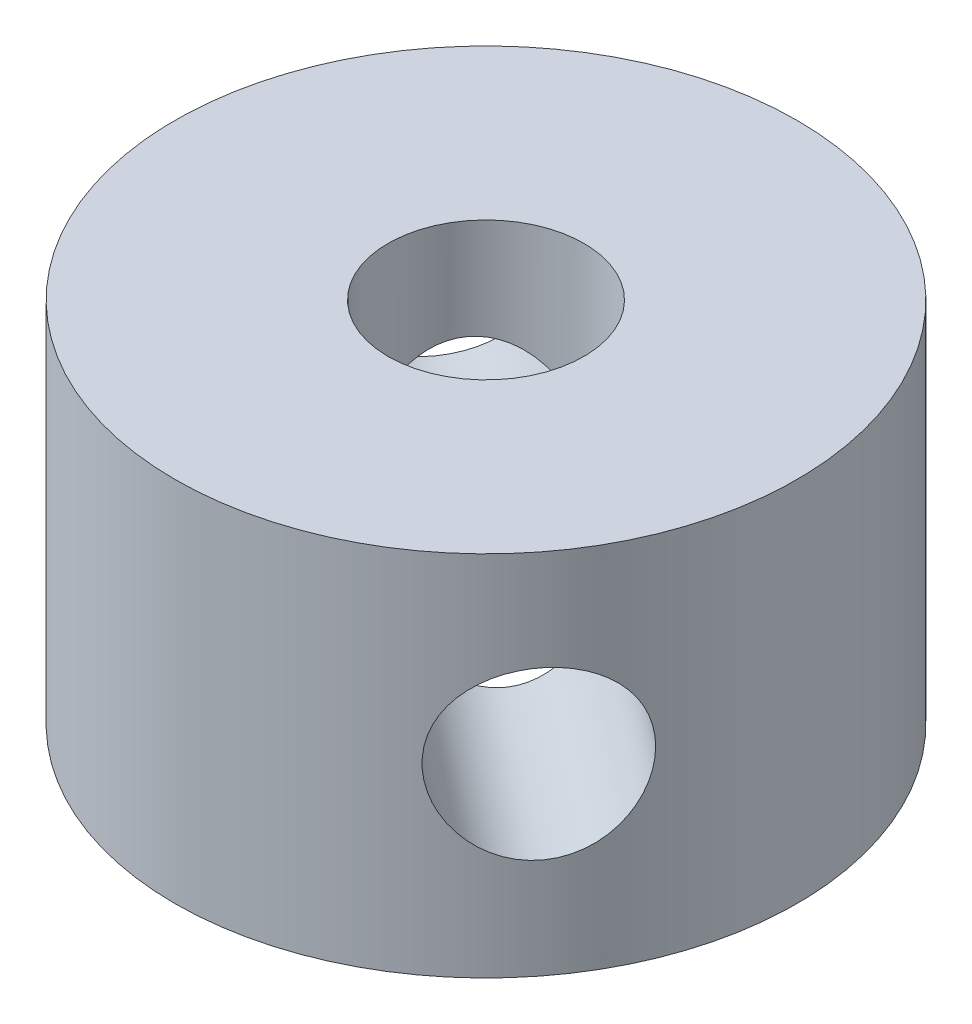
ISO-10303-21;
HEADER;
FILE_DESCRIPTION(('STEP AP214'),'2;1');
FILE_NAME('part.step','',(''),(''),'','','');
FILE_SCHEMA(('AUTOMOTIVE_DESIGN { 1 0 10303 214 1 1 1 1 }'));
ENDSEC;
DATA;
#1=APPLICATION_CONTEXT('core data for automotive mechanical design processes');
#2=APPLICATION_PROTOCOL_DEFINITION('international standard','automotive_design',2000,#1);
#3=PRODUCT_CONTEXT('',#1,'mechanical');
#4=PRODUCT('Part','Part','',(#3));
#5=PRODUCT_RELATED_PRODUCT_CATEGORY('part','',(#4));
#6=PRODUCT_DEFINITION_FORMATION('','',#4);
#7=PRODUCT_DEFINITION_CONTEXT('part definition',#1,'design');
#8=PRODUCT_DEFINITION('design','',#6,#7);
#9=PRODUCT_DEFINITION_SHAPE('','',#8);
#10=(LENGTH_UNIT() NAMED_UNIT(*) SI_UNIT(.MILLI.,.METRE.));
#11=(NAMED_UNIT(*) PLANE_ANGLE_UNIT() SI_UNIT($,.RADIAN.));
#12=(NAMED_UNIT(*) SI_UNIT($,.STERADIAN.) SOLID_ANGLE_UNIT());
#13=UNCERTAINTY_MEASURE_WITH_UNIT(LENGTH_MEASURE(1.E-05),#10,'distance_accuracy_value','');
#14=(GEOMETRIC_REPRESENTATION_CONTEXT(3) GLOBAL_UNCERTAINTY_ASSIGNED_CONTEXT((#13)) GLOBAL_UNIT_ASSIGNED_CONTEXT((#10,
#11,#12)) REPRESENTATION_CONTEXT('',''));
#15=CARTESIAN_POINT('',(0.,0.,0.));
#16=DIRECTION('',(0.,0.,1.));
#17=DIRECTION('',(1.,0.,0.));
#18=AXIS2_PLACEMENT_3D('',#15,#16,#17);
#19=CARTESIAN_POINT('',(0.,15.,0.));
#20=DIRECTION('',(0.,1.,0.));
#21=DIRECTION('',(0.,0.,1.));
#22=AXIS2_PLACEMENT_3D('',#19,#20,#21);
#23=PLANE('',#22);
#24=CARTESIAN_POINT('',(0.,15.,0.));
#25=DIRECTION('',(0.,1.,0.));
#26=DIRECTION('',(0.,0.,1.));
#27=AXIS2_PLACEMENT_3D('',#24,#25,#26);
#28=CIRCLE('',#27,12.7);
#29=CARTESIAN_POINT('',(0.,15.,12.7));
#30=VERTEX_POINT('',#29);
#31=EDGE_CURVE('E10',#30,#30,#28,.T.);
#32=ORIENTED_EDGE('',*,*,#31,.T.);
#33=EDGE_LOOP('',(#32));
#34=FACE_BOUND('',#33,.T.);
#35=CARTESIAN_POINT('',(0.,15.,0.));
#36=DIRECTION('',(0.,1.,0.));
#37=DIRECTION('',(0.,0.,1.));
#38=AXIS2_PLACEMENT_3D('',#35,#36,#37);
#39=CIRCLE('',#38,4.);
#40=CARTESIAN_POINT('',(0.,15.,4.));
#41=VERTEX_POINT('',#40);
#42=EDGE_CURVE('E47',#41,#41,#39,.T.);
#43=ORIENTED_EDGE('',*,*,#42,.F.);
#44=EDGE_LOOP('',(#43));
#45=FACE_BOUND('',#44,.T.);
#46=ADVANCED_FACE('F29',(#34,#45),#23,.T.);
#47=CARTESIAN_POINT('',(0.,0.,0.));
#48=DIRECTION('',(0.,1.,0.));
#49=DIRECTION('',(0.,0.,1.));
#50=AXIS2_PLACEMENT_3D('',#47,#48,#49);
#51=PLANE('',#50);
#52=CARTESIAN_POINT('',(0.,0.,0.));
#53=DIRECTION('',(0.,1.,0.));
#54=DIRECTION('',(0.,0.,1.));
#55=AXIS2_PLACEMENT_3D('',#52,#53,#54);
#56=CIRCLE('',#55,12.7);
#57=CARTESIAN_POINT('',(0.,0.,12.7));
#58=VERTEX_POINT('',#57);
#59=EDGE_CURVE('E42',#58,#58,#56,.T.);
#60=ORIENTED_EDGE('',*,*,#59,.F.);
#61=EDGE_LOOP('',(#60));
#62=FACE_BOUND('',#61,.T.);
#63=CARTESIAN_POINT('',(0.,0.,0.));
#64=DIRECTION('',(0.,1.,0.));
#65=DIRECTION('',(0.,0.,1.));
#66=AXIS2_PLACEMENT_3D('',#63,#64,#65);
#67=CIRCLE('',#66,4.);
#68=CARTESIAN_POINT('',(0.,0.,4.));
#69=VERTEX_POINT('',#68);
#70=EDGE_CURVE('E50',#69,#69,#67,.T.);
#71=ORIENTED_EDGE('',*,*,#70,.T.);
#72=EDGE_LOOP('',(#71));
#73=FACE_BOUND('',#72,.T.);
#74=ADVANCED_FACE('F83',(#62,#73),#51,.F.);
#75=CARTESIAN_POINT('',(0.,15.,0.));
#76=DIRECTION('',(0.,-1.,0.));
#77=DIRECTION('',(0.,0.,-1.));
#78=AXIS2_PLACEMENT_3D('',#75,#76,#77);
#79=CYLINDRICAL_SURFACE('',#78,12.7);
#80=CARTESIAN_POINT('',(-7.57783832704568,7.5,-10.1914849893996));
#81=CARTESIAN_POINT('',(-7.5778436047528,7.68726973662798,-10.1914834420314));
#82=CARTESIAN_POINT('',(-7.59079414651676,7.87458655293833,-10.1818905849294));
#83=CARTESIAN_POINT('',(-7.6418597963996,8.24380846684743,-10.1436168828269));
#84=CARTESIAN_POINT('',(-7.67998739980899,8.42571083040032,-10.1149265597619));
#85=CARTESIAN_POINT('',(-7.77921370792836,8.77870912995359,-10.0388100963512));
#86=CARTESIAN_POINT('',(-7.84027993677805,8.94981994619633,-9.99141043935746));
#87=CARTESIAN_POINT('',(-7.98228728910249,9.27707540057226,-9.87832449553057));
#88=CARTESIAN_POINT('',(-8.06323000109302,9.43321884113498,-9.81263674706868));
#89=CARTESIAN_POINT('',(-8.24332596919391,9.73004359225751,-9.66186550021349));
#90=CARTESIAN_POINT('',(-8.34285201261102,9.870291718828,-9.57637430517092));
#91=CARTESIAN_POINT('',(-8.55452011076351,10.1275144693224,-9.3877712153447));
#92=CARTESIAN_POINT('',(-8.66666348028813,10.2444866642538,-9.28465748362143));
#93=CARTESIAN_POINT('',(-8.90093289629711,10.4536457229853,-9.0603571782758));
#94=CARTESIAN_POINT('',(-9.02319095570416,10.545401605151,-8.93890552481103));
#95=CARTESIAN_POINT('',(-9.27121194111815,10.6987121552296,-8.68139023531302));
#96=CARTESIAN_POINT('',(-9.39697426744019,10.7602719574562,-8.54532908816683));
#97=CARTESIAN_POINT('',(-9.64435728601031,10.8500399767108,-8.26501630414344));
#98=CARTESIAN_POINT('',(-9.76600657586395,10.8789851457648,-8.12102617671603));
#99=CARTESIAN_POINT('',(-10.0040007787032,10.9050211856545,-7.8259738298319));
#100=CARTESIAN_POINT('',(-10.1203465829009,10.9021174284324,-7.67491280729929));
#101=CARTESIAN_POINT('',(-10.3414418268925,10.8650562824657,-7.37418140314894));
#102=CARTESIAN_POINT('',(-10.4464108526457,10.8316951615962,-7.22457326833038));
#103=CARTESIAN_POINT('',(-10.645689678811,10.735953115979,-6.92757480809791));
#104=CARTESIAN_POINT('',(-10.7399988686368,10.6735705299526,-6.78018461014427));
#105=CARTESIAN_POINT('',(-10.9173348379818,10.5209482305128,-6.49083268834331));
#106=CARTESIAN_POINT('',(-11.0002394543113,10.4304363696598,-6.3489399298484));
#107=CARTESIAN_POINT('',(-11.1529068786385,10.2243338871114,-6.07676357419525));
#108=CARTESIAN_POINT('',(-11.2226671025521,10.1087383437522,-5.94648226240352));
#109=CARTESIAN_POINT('',(-11.3508329288665,9.85152573608237,-5.69813521241583));
#110=CARTESIAN_POINT('',(-11.4088205075063,9.70921430616648,-5.58057205153704));
#111=CARTESIAN_POINT('',(-11.510861466101,9.40480403456947,-5.36694722184663));
#112=CARTESIAN_POINT('',(-11.5549139825977,9.24270396758746,-5.27088688552203));
#113=CARTESIAN_POINT('',(-11.6296903701343,8.90189217395994,-5.10379970386253));
#114=CARTESIAN_POINT('',(-11.660329110575,8.72308284534323,-5.03293327011513));
#115=CARTESIAN_POINT('',(-11.7082268309842,8.35478801789811,-4.92048790980176));
#116=CARTESIAN_POINT('',(-11.7254891592104,8.16530520350294,-4.87890165433501));
#117=CARTESIAN_POINT('',(-11.7465590317981,7.78715555076942,-4.82794922864783));
#118=CARTESIAN_POINT('',(-11.750755985831,7.59863587650594,-4.81765076657309));
#119=CARTESIAN_POINT('',(-11.7468545703552,7.22249944448766,-4.82715603032749));
#120=CARTESIAN_POINT('',(-11.7387575211034,7.03488259194906,-4.84695652382038));
#121=CARTESIAN_POINT('',(-11.7104408132174,6.66964387693809,-4.91496435529023));
#122=CARTESIAN_POINT('',(-11.6904594553272,6.49189870683022,-4.96261297309498));
#123=CARTESIAN_POINT('',(-11.6383321296367,6.14729891915067,-5.0836541555927));
#124=CARTESIAN_POINT('',(-11.606184563991,5.98044573545128,-5.15705010171122));
#125=CARTESIAN_POINT('',(-11.5285460638269,5.65828983881531,-5.32837986344278));
#126=CARTESIAN_POINT('',(-11.4827755769043,5.50332446387139,-5.42682077079933));
#127=CARTESIAN_POINT('',(-11.3778438711069,5.21299248784549,-5.64350345425796));
#128=CARTESIAN_POINT('',(-11.3186801139271,5.07762960983102,-5.76174898264372));
#129=CARTESIAN_POINT('',(-11.1848742435775,4.82629065312896,-6.01747238896173));
#130=CARTESIAN_POINT('',(-11.1098311097815,4.71099494578228,-6.15541051587384));
#131=CARTESIAN_POINT('',(-10.9456727982268,4.50805335263398,-6.44279361706361));
#132=CARTESIAN_POINT('',(-10.8565583700391,4.42040599476322,-6.59223797819257));
#133=CARTESIAN_POINT('',(-10.6660066658548,4.27605586551412,-6.89624587455576));
#134=CARTESIAN_POINT('',(-10.5646687649212,4.21912173517182,-7.05076156172284));
#135=CARTESIAN_POINT('',(-10.3511010654638,4.13714474318385,-7.36071207653181));
#136=CARTESIAN_POINT('',(-10.2388737072111,4.11209475414943,-7.51614669094881));
#137=CARTESIAN_POINT('',(-10.010095831979,4.09504656156014,-7.81810473509376));
#138=CARTESIAN_POINT('',(-9.89378615405394,4.10205070261329,-7.96475510386846));
#139=CARTESIAN_POINT('',(-9.65722013497768,4.14659344348425,-8.24999599157653));
#140=CARTESIAN_POINT('',(-9.53696394426806,4.18413088066336,-8.38858681718374));
#141=CARTESIAN_POINT('',(-9.29736349854847,4.28810879276722,-8.65336468157148));
#142=CARTESIAN_POINT('',(-9.17801874394014,4.35434543570834,-8.77963163904919));
#143=CARTESIAN_POINT('',(-8.94353786504196,4.51365963122831,-9.01837909484101));
#144=CARTESIAN_POINT('',(-8.82840233716123,4.60674097097563,-9.13085764473551));
#145=CARTESIAN_POINT('',(-8.60354295278243,4.82001427254258,-9.3431051542554));
#146=CARTESIAN_POINT('',(-8.49404720142655,4.94086666474538,-9.44245209979029));
#147=CARTESIAN_POINT('',(-8.28829746438769,5.20500085840212,-9.62356236416411));
#148=CARTESIAN_POINT('',(-8.19204697989896,5.34828856899103,-9.70532103700279));
#149=CARTESIAN_POINT('',(-8.01506122317872,5.65705521705059,-9.8520216125505));
#150=CARTESIAN_POINT('',(-7.93471810664693,5.82295640729238,-9.91654959774787));
#151=CARTESIAN_POINT('',(-7.79638964931631,6.16987653102387,-10.0256731644621));
#152=CARTESIAN_POINT('',(-7.73838979672668,6.35088555880452,-10.0702816865353));
#153=CARTESIAN_POINT('',(-7.65526928965326,6.69266843196358,-10.1335632688402));
#154=CARTESIAN_POINT('',(-7.6263449625111,6.85197163672154,-10.1552666712078));
#155=CARTESIAN_POINT('',(-7.58762829594272,7.17417162801127,-10.1842273660031));
#156=CARTESIAN_POINT('',(-7.57783373523379,7.33706799509572,-10.1914863356705));
#157=CARTESIAN_POINT('',(-7.57783832704568,7.5,-10.1914849893996));
#158=B_SPLINE_CURVE_WITH_KNOTS('',3,(#80,#81,#82,#83,#84,#85,#86,#87,#88,#89,#90,#91,#92,#93,
#94,#95,#96,#97,#98,#99,#100,#101,#102,#103,#104,#105,#106,#107,#108,#109,#110,#111,#112,#113,
#114,#115,#116,#117,#118,#119,#120,#121,#122,#123,#124,#125,#126,#127,#128,#129,#130,#131,#132,
#133,#134,#135,#136,#137,#138,#139,#140,#141,#142,#143,#144,#145,#146,#147,#148,#149,#150,#151,
#152,#153,#154,#155,#156,#157),.UNSPECIFIED.,.T.,.F.,(4,2,2,2,2,2,2,2,2,2,2,2,2,2,2,2,2,2,2,2,2,
2,2,2,2,2,2,2,2,2,2,2,2,2,2,2,2,2,4),(0.,0.561210028910166,1.12269879400504,1.68339559703856,
2.24413722519304,2.8176507940926,3.39122418145617,3.97406458533161,4.55680585303685,
5.12609765265885,5.69529343159981,6.25002162742606,6.80478158152167,7.36508526629862,
7.92549898770585,8.5032494583411,9.08103572111174,9.66243755078668,10.2436938023665,
10.8074514074565,11.3711484747178,11.9239064323611,12.476737011522,13.0418020792269,
13.6069743283777,14.1886260154254,14.7702467286144,15.3474227148972,15.9244696564464,
16.4836808433044,17.042870737665,17.5981525470666,18.1535127322957,18.7237746599712,
19.2941870397495,19.8772706995605,20.4599750096082,20.9483064201447,21.4365811239447),.UNSPECIFIED.);
#159=CARTESIAN_POINT('',(-7.57783832704568,7.5,-10.1914849893996));
#160=VERTEX_POINT('',#159);
#161=EDGE_CURVE('E73',#160,#160,#158,.T.);
#162=ORIENTED_EDGE('',*,*,#161,.T.);
#163=EDGE_LOOP('',(#162));
#164=FACE_BOUND('',#163,.T.);
#165=CARTESIAN_POINT('',(11.7492688401176,7.5,4.82127386928418));
#166=CARTESIAN_POINT('',(11.7492686463797,7.31273026337202,4.82127936573816));
#167=CARTESIAN_POINT('',(11.7431774823799,7.12541344706167,4.83620039655004));
#168=CARTESIAN_POINT('',(11.7187253240936,6.75619153315257,4.89514671811234));
#169=CARTESIAN_POINT('',(11.700358237253,6.57428916959968,4.9391864603948));
#170=CARTESIAN_POINT('',(11.6511528640331,6.22129087004641,5.05415779365423));
#171=CARTESIAN_POINT('',(11.6203322044244,6.05018005380367,5.12505136691955));
#172=CARTESIAN_POINT('',(11.5458890079485,5.72292459942774,5.29061926629582));
#173=CARTESIAN_POINT('',(11.5022654478274,5.56678115886502,5.38529549311509));
#174=CARTESIAN_POINT('',(11.4007300916999,5.2699564077425,5.59709043654039));
#175=CARTESIAN_POINT('',(11.3425154856514,5.129708281172,5.71467120618702));
#176=CARTESIAN_POINT('',(11.2121340087026,4.87248553067756,5.96641548067233));
#177=CARTESIAN_POINT('',(11.13996568319,4.75551333574622,6.10058071384002));
#178=CARTESIAN_POINT('',(10.9805872722512,4.54635427701471,6.38305426726045));
#179=CARTESIAN_POINT('',(10.8931530011788,4.45459839484901,6.53155607014962));
#180=CARTESIAN_POINT('',(10.7049935913475,4.30128784477044,6.8355701652553));
#181=CARTESIAN_POINT('',(10.6042707157813,4.23972804254379,6.9910812607512));
#182=CARTESIAN_POINT('',(10.3938645127594,4.14996002328921,7.30011660580693));
#183=CARTESIAN_POINT('',(10.2844416415596,4.12101485423519,7.45360387491044));
#184=CARTESIAN_POINT('',(10.057431460395,4.09497881434546,7.75718830408059));
#185=CARTESIAN_POINT('',(9.93984553061372,4.0978825715676,7.90728603157993));
#186=CARTESIAN_POINT('',(9.70315251362128,4.13494371753427,8.19590151984233));
#187=CARTESIAN_POINT('',(9.58416005738833,4.16830483840377,8.33461664422002));
#188=CARTESIAN_POINT('',(9.34568726773375,4.264046884021,8.601170324616));
#189=CARTESIAN_POINT('',(9.22620690677108,4.32642947004736,8.72900825749452));
#190=CARTESIAN_POINT('',(8.98971503282222,4.47905176948722,8.97240951926117));
#191=CARTESIAN_POINT('',(8.87274012247514,4.56956363034021,9.08783742174283));
#192=CARTESIAN_POINT('',(8.64678779269354,4.7756661128886,9.3030881027954));
#193=CARTESIAN_POINT('',(8.53781194837762,4.89126165624784,9.40290781226347));
#194=CARTESIAN_POINT('',(8.3288874107891,5.14847426391763,9.58852374333042));
#195=CARTESIAN_POINT('',(8.22932226937815,5.29078569383352,9.6737906108004));
#196=CARTESIAN_POINT('',(8.04757835562789,5.59519596543053,9.82550440353497));
#197=CARTESIAN_POINT('',(7.96540066077112,5.75729603241254,9.8919501625608));
#198=CARTESIAN_POINT('',(7.82200366443025,6.09810782604006,10.0057347654223));
#199=CARTESIAN_POINT('',(7.76091873050725,6.27691715465677,10.052951443572));
#200=CARTESIAN_POINT('',(7.66381641905201,6.64521198210189,10.1271760472183));
#201=CARTESIAN_POINT('',(7.62779276864567,6.83469479649706,10.1541890298551));
#202=CARTESIAN_POINT('',(7.58363590338838,7.21284444923058,10.1872081222854));
#203=CARTESIAN_POINT('',(7.57469569883532,7.40136412349406,10.1938221593891));
#204=CARTESIAN_POINT('',(7.58294046359827,7.77750055551234,10.1876906884596));
#205=CARTESIAN_POINT('',(7.60012262762499,7.96511740805093,10.1749472592309));
#206=CARTESIAN_POINT('',(7.65901219914569,8.33035612306191,10.1306875772072));
#207=CARTESIAN_POINT('',(7.70023719889152,8.50810129316978,10.0995404290584));
#208=CARTESIAN_POINT('',(7.80462191378992,8.85270108084933,10.0190913318623));
#209=CARTESIAN_POINT('',(7.86778451002084,9.01955426454871,9.969786998169));
#210=CARTESIAN_POINT('',(8.01458423547323,9.34171016118468,9.85217975107157));
#211=CARTESIAN_POINT('',(8.09864354417884,9.49667553612861,9.7834805346696));
#212=CARTESIAN_POINT('',(8.28263519708248,9.7870075121545,9.62820941741281));
#213=CARTESIAN_POINT('',(8.38257054905086,9.92237039016897,9.54163412894194));
#214=CARTESIAN_POINT('',(8.59724702494067,10.173709346871,9.34872875789584));
#215=CARTESIAN_POINT('',(8.71233489393796,10.2890050542177,9.2418962666041));
#216=CARTESIAN_POINT('',(8.95017887734529,10.491946647366,9.0117501441973));
#217=CARTESIAN_POINT('',(9.07293458308295,10.5795940052368,8.88843739103158));
#218=CARTESIAN_POINT('',(9.32035778333469,10.7239441344859,8.62860568974036));
#219=CARTESIAN_POINT('',(9.44500349912664,10.7808782648282,8.49219486435956));
#220=CARTESIAN_POINT('',(9.69249118955443,10.8628552568162,8.20859245434059));
#221=CARTESIAN_POINT('',(9.81533356123911,10.8879052458506,8.06140328687836));
#222=CARTESIAN_POINT('',(10.0513146524169,10.9049534384399,7.76504050037148));
#223=CARTESIAN_POINT('',(10.1646359419439,10.8979492973867,7.61606883467387));
#224=CARTESIAN_POINT('',(10.3824928786036,10.8534065565158,7.31629525253004));
#225=CARTESIAN_POINT('',(10.4870288600936,10.8158691193366,7.16549340598832));
#226=CARTESIAN_POINT('',(10.6843081131769,10.7118912072328,6.86784161721218));
#227=CARTESIAN_POINT('',(10.7771286961203,10.6456545642917,6.72097142151118));
#228=CARTESIAN_POINT('',(10.9504529508169,10.4863403687717,6.43471920239346));
#229=CARTESIAN_POINT('',(11.0309548822376,10.3932590290244,6.29533823882858));
#230=CARTESIAN_POINT('',(11.1809828300615,10.1799857274574,6.02496375239846));
#231=CARTESIAN_POINT('',(11.2501563740891,10.0591333352546,5.89429563861867));
#232=CARTESIAN_POINT('',(11.3747419102846,9.79499914159789,5.65013928231394));
#233=CARTESIAN_POINT('',(11.4301502669298,9.65171143100897,5.53665558144669));
#234=CARTESIAN_POINT('',(11.5285108319245,9.34294478294941,5.32888114557501));
#235=CARTESIAN_POINT('',(11.5711589938421,9.17704359270762,5.23507276890894));
#236=CARTESIAN_POINT('',(11.6426730023499,8.83012346897613,5.07404959819415));
#237=CARTESIAN_POINT('',(11.6715477975573,8.64911444119548,5.00681754227057));
#238=CARTESIAN_POINT('',(11.7123012531884,8.30733156803642,4.91062641373335));
#239=CARTESIAN_POINT('',(11.72617516685,8.14802836327846,4.87723226911678));
#240=CARTESIAN_POINT('',(11.7446585067756,7.82582837198872,4.83255488939967));
#241=CARTESIAN_POINT('',(11.7492690086771,7.66293200490428,4.82126908715396));
#242=CARTESIAN_POINT('',(11.7492688401176,7.5,4.82127386928418));
#243=B_SPLINE_CURVE_WITH_KNOTS('',3,(#165,#166,#167,#168,#169,#170,#171,#172,#173,#174,#175,
#176,#177,#178,#179,#180,#181,#182,#183,#184,#185,#186,#187,#188,#189,#190,#191,#192,#193,#194,
#195,#196,#197,#198,#199,#200,#201,#202,#203,#204,#205,#206,#207,#208,#209,#210,#211,#212,#213,
#214,#215,#216,#217,#218,#219,#220,#221,#222,#223,#224,#225,#226,#227,#228,#229,#230,#231,#232,
#233,#234,#235,#236,#237,#238,#239,#240,#241,#242),.UNSPECIFIED.,.T.,.F.,(4,2,2,2,2,2,2,2,2,2,2,
2,2,2,2,2,2,2,2,2,2,2,2,2,2,2,2,2,2,2,2,2,2,2,2,2,2,2,4),(0.,0.561210028910163,1.12269879400504,
1.68339559703856,2.24413722519304,2.8176507940926,3.39122418145617,3.97406458533161,
4.55680585303685,5.12609765265885,5.69529343159981,6.25002162742606,6.80478158152167,
7.36508526629862,7.92549898770585,8.5032494583411,9.08103572111174,9.66243755078669,
10.2436938023665,10.8074514074565,11.3711484747178,11.9239064323611,12.476737011522,
13.0418020792269,13.6069743283777,14.1886260154254,14.7702467286144,15.3474227148972,
15.9244696564464,16.4836808433044,17.042870737665,17.5981525470666,18.1535127322957,
18.7237746599712,19.2941870397496,19.8772706995605,20.4599750096082,20.9483064201447,
21.4365811239447),.UNSPECIFIED.);
#244=CARTESIAN_POINT('',(11.7492688401176,7.5,4.82127386928418));
#245=VERTEX_POINT('',#244);
#246=EDGE_CURVE('E69',#245,#245,#243,.T.);
#247=ORIENTED_EDGE('',*,*,#246,.T.);
#248=EDGE_LOOP('',(#247));
#249=FACE_BOUND('',#248,.T.);
#250=ORIENTED_EDGE('',*,*,#31,.F.);
#251=EDGE_LOOP('',(#250));
#252=FACE_BOUND('',#251,.T.);
#253=ORIENTED_EDGE('',*,*,#59,.T.);
#254=EDGE_LOOP('',(#253));
#255=FACE_BOUND('',#254,.T.);
#256=ADVANCED_FACE('F31',(#164,#249,#252,#255),#79,.T.);
#257=CARTESIAN_POINT('',(0.,15.,0.));
#258=DIRECTION('',(0.,-1.,0.));
#259=DIRECTION('',(0.,0.,-1.));
#260=AXIS2_PLACEMENT_3D('',#257,#258,#259);
#261=CYLINDRICAL_SURFACE('',#260,4.);
#262=CARTESIAN_POINT('',(0.,8.75739783550903,-4.));
#263=CARTESIAN_POINT('',(-0.065126820506217,8.85778108585833,-3.99999666614935));
#264=CARTESIAN_POINT('',(-0.135180915908706,8.95502753663822,-3.99839390802834));
#265=CARTESIAN_POINT('',(-0.282657701272893,9.14364744508532,-3.99068682568454));
#266=CARTESIAN_POINT('',(-0.360088690727194,9.23501408932807,-3.98457737778835));
#267=CARTESIAN_POINT('',(-0.521007802497584,9.41250482965618,-3.96675390259222));
#268=CARTESIAN_POINT('',(-0.604524130464274,9.49860059678489,-3.9550121564314));
#269=CARTESIAN_POINT('',(-0.775953502984261,9.6650141928983,-3.92498032474404));
#270=CARTESIAN_POINT('',(-0.863864825934194,9.74533425473566,-3.90669278630362));
#271=CARTESIAN_POINT('',(-1.0433163653419,9.90020062994587,-3.86264823950803));
#272=CARTESIAN_POINT('',(-1.13486616109831,9.9747299332733,-3.83687020701345));
#273=CARTESIAN_POINT('',(-1.32037475140823,10.1172651941441,-3.77705073187328));
#274=CARTESIAN_POINT('',(-1.41433406878169,10.1852697204965,-3.74300748203117));
#275=CARTESIAN_POINT('',(-1.60321542983969,10.3137355652429,-3.66606771227044));
#276=CARTESIAN_POINT('',(-1.69813222112606,10.3742255509564,-3.62320660629614));
#277=CARTESIAN_POINT('',(-1.8880122829659,10.4869742337571,-3.52798683187096));
#278=CARTESIAN_POINT('',(-1.98297548718488,10.5392380620408,-3.47563412816658));
#279=CARTESIAN_POINT('',(-2.20163094959523,10.6496125163506,-3.3427436825254));
#280=CARTESIAN_POINT('',(-2.3248749608821,10.7043137194357,-3.25853416425333));
#281=CARTESIAN_POINT('',(-2.56520255006932,10.7948013714836,-3.07290658596412));
#282=CARTESIAN_POINT('',(-2.68228988040591,10.8305994649014,-2.97149917096809));
#283=CARTESIAN_POINT('',(-2.90665133566013,10.8811609820357,-2.75246242831391));
#284=CARTESIAN_POINT('',(-3.01387257901338,10.8958166085437,-2.63475329804156));
#285=CARTESIAN_POINT('',(-3.21370037333547,10.9026258574809,-2.38693318439708));
#286=CARTESIAN_POINT('',(-3.30630918853968,10.8947829697356,-2.25682412744874));
#287=CARTESIAN_POINT('',(-3.46750913786687,10.8587057669938,-1.99941030533439));
#288=CARTESIAN_POINT('',(-3.53741468970233,10.8321198438837,-1.87268662594291));
#289=CARTESIAN_POINT('',(-3.66163131634183,10.7619585949701,-1.61640159443316));
#290=CARTESIAN_POINT('',(-3.71593978233189,10.7183804298653,-1.48683977149477));
#291=CARTESIAN_POINT('',(-3.81235121674611,10.6129451068382,-1.2196187635234));
#292=CARTESIAN_POINT('',(-3.85341136704224,10.5500709173915,-1.08198984361384));
#293=CARTESIAN_POINT('',(-3.9195618781171,10.4099496996947,-0.810333333539544));
#294=CARTESIAN_POINT('',(-3.94464152440643,10.3326930731671,-0.676308217172916));
#295=CARTESIAN_POINT('',(-3.98959200153742,10.124808115108,-0.349423421389741));
#296=CARTESIAN_POINT('',(-4.00081361638621,9.98663378991665,-0.160097938162655));
#297=CARTESIAN_POINT('',(-3.99952076987924,9.76253680007414,0.109534664718918));
#298=CARTESIAN_POINT('',(-3.99604730782718,9.68488398401897,0.197157652188263));
#299=CARTESIAN_POINT('',(-3.98404250214345,9.52412077536859,0.366904970070717));
#300=CARTESIAN_POINT('',(-3.97551254377495,9.44101188304746,0.449030799614093));
#301=CARTESIAN_POINT('',(-3.95631971733811,9.28424600438319,0.59318988850397));
#302=CARTESIAN_POINT('',(-3.94628142246746,9.21144229301964,0.656240749004284));
#303=CARTESIAN_POINT('',(-3.92423088676858,9.06199773500988,0.777298922961893));
#304=CARTESIAN_POINT('',(-3.91221828547238,8.98535618943375,0.835305312439126));
#305=CARTESIAN_POINT('',(-3.88712677797505,8.82824636270887,0.945204898629376));
#306=CARTESIAN_POINT('',(-3.87405070346513,8.74778846717906,0.997113484686858));
#307=CARTESIAN_POINT('',(-3.84790053958559,8.58268448071376,1.09369234393404));
#308=CARTESIAN_POINT('',(-3.83482645518385,8.49804134778659,1.13836763659184));
#309=CARTESIAN_POINT('',(-3.80772418187121,8.30826242056589,1.226263283093));
#310=CARTESIAN_POINT('',(-3.79396638979886,8.20223085074936,1.26768802912866));
#311=CARTESIAN_POINT('',(-3.77107846489302,7.98479823263816,1.33425282837696));
#312=CARTESIAN_POINT('',(-3.76193661938743,7.87341156806022,1.35943414383865));
#313=CARTESIAN_POINT('',(-3.75066268515261,7.6462893898217,1.39026629488652));
#314=CARTESIAN_POINT('',(-3.74860328374738,7.53052103839356,1.39571464045398));
#315=CARTESIAN_POINT('',(-3.75237921182361,7.30002256881413,1.38551918184853));
#316=CARTESIAN_POINT('',(-3.75822099877753,7.18529337712199,1.36985812544824));
#317=CARTESIAN_POINT('',(-3.77754052917092,6.9410818140401,1.31571564117143));
#318=CARTESIAN_POINT('',(-3.79216845107592,6.81249869974983,1.27374262014601));
#319=CARTESIAN_POINT('',(-3.82525717140632,6.56365805585475,1.17060323260249));
#320=CARTESIAN_POINT('',(-3.84373127813058,6.4434314201075,1.10936983661942));
#321=CARTESIAN_POINT('',(-3.87730568783178,6.23184187946388,0.984844372006697));
#322=CARTESIAN_POINT('',(-3.89242789882924,6.13912149695634,0.923808583418718));
#323=CARTESIAN_POINT('',(-3.9209713642113,5.95894069783252,0.79397835999041));
#324=CARTESIAN_POINT('',(-3.93439156229079,5.87148356521951,0.725179156573777));
#325=CARTESIAN_POINT('',(-3.95824628372366,5.70149993537285,0.581062726312166));
#326=CARTESIAN_POINT('',(-3.96867677800137,5.61898020936395,0.505736880102246));
#327=CARTESIAN_POINT('',(-3.98546817966282,5.45891492673235,0.349586446726515));
#328=CARTESIAN_POINT('',(-3.99182998230179,5.38136827923855,0.26876307354316));
#329=CARTESIAN_POINT('',(-3.99974283689717,5.22775873369299,0.0983603948689412));
#330=CARTESIAN_POINT('',(-4.00105084116529,5.15194157789137,0.00854750396018699));
#331=CARTESIAN_POINT('',(-3.99720405540699,5.00618068454173,-0.175636138101857));
#332=CARTESIAN_POINT('',(-3.99204807589433,4.93623803053232,-0.270007725062212));
#333=CARTESIAN_POINT('',(-3.97436212058428,4.80297574932991,-0.462323260361624));
#334=CARTESIAN_POINT('',(-3.9618514063886,4.73963932911047,-0.560257252761896));
#335=CARTESIAN_POINT('',(-3.92860865647433,4.62016249889093,-0.759075910571299));
#336=CARTESIAN_POINT('',(-3.9078771250106,4.56402164780286,-0.859960394649395));
#337=CARTESIAN_POINT('',(-3.84729990936199,4.43902346814341,-1.10446733912173));
#338=CARTESIAN_POINT('',(-3.80312700724386,4.37404438199141,-1.24906433929819));
#339=CARTESIAN_POINT('',(-3.69551108573344,4.26302951968042,-1.53848420424038));
#340=CARTESIAN_POINT('',(-3.63208192421939,4.21698017654033,-1.6833068323109));
#341=CARTESIAN_POINT('',(-3.52221191215075,4.16410492352039,-1.89751747084985));
#342=CARTESIAN_POINT('',(-3.48294901518763,4.14915300510783,-1.96869301081546));
#343=CARTESIAN_POINT('',(-3.39968752813376,4.12502395792094,-2.10921260685073));
#344=CARTESIAN_POINT('',(-3.35569117350907,4.11584411707068,-2.17855750837119));
#345=CARTESIAN_POINT('',(-3.26323365772662,4.10344482975682,-2.31475241675572));
#346=CARTESIAN_POINT('',(-3.214772988122,4.10022472790466,-2.3816026971593));
#347=CARTESIAN_POINT('',(-3.11381365988042,4.09979766894579,-2.5121679387106));
#348=CARTESIAN_POINT('',(-3.06131533343188,4.10259021767206,-2.57588315708221));
#349=CARTESIAN_POINT('',(-2.90979825340741,4.11873446800722,-2.74858525909931));
#350=CARTESIAN_POINT('',(-2.80679417815803,4.13868534243008,-2.8535696417198));
#351=CARTESIAN_POINT('',(-2.59282015091694,4.19654030937303,-3.04932499766726));
#352=CARTESIAN_POINT('',(-2.48184877407012,4.23444762000305,-3.14009341936187));
#353=CARTESIAN_POINT('',(-2.25151786877375,4.32775378283687,-3.30934548700106));
#354=CARTESIAN_POINT('',(-2.1320015900885,4.38370069156219,-3.38731002588515));
#355=CARTESIAN_POINT('',(-1.89149038422472,4.51016482871808,-3.52727690097288));
#356=CARTESIAN_POINT('',(-1.77049499847811,4.58068668945204,-3.58927414824528));
#357=CARTESIAN_POINT('',(-1.47235024724679,4.7706742614386,-3.72426448224422));
#358=CARTESIAN_POINT('',(-1.29583454180864,4.89747459053333,-3.78848658456251));
#359=CARTESIAN_POINT('',(-1.0382909770303,5.10417645309153,-3.86394238057904));
#360=CARTESIAN_POINT('',(-0.95345997584803,5.17601308936935,-3.88564062091961));
#361=CARTESIAN_POINT('',(-0.7870587537514,5.32489706235596,-3.92272633839229));
#362=CARTESIAN_POINT('',(-0.705487261255132,5.40194233489169,-3.93811629860326));
#363=CARTESIAN_POINT('',(-0.544963829387449,5.56264363557869,-3.96355281055413));
#364=CARTESIAN_POINT('',(-0.466094976179353,5.64639988706464,-3.97348830414432));
#365=CARTESIAN_POINT('',(-0.313847014179823,5.81926934309515,-3.98840157798225));
#366=CARTESIAN_POINT('',(-0.240470592693488,5.90838513196229,-3.99337694584489));
#367=CARTESIAN_POINT('',(-0.101117835889126,6.09187739819412,-3.99932706720739));
#368=CARTESIAN_POINT('',(-0.0351155269923047,6.18623353775015,-4.00031632249192));
#369=CARTESIAN_POINT('',(0.0874376223355004,6.3808021861468,-3.99951257658164));
#370=CARTESIAN_POINT('',(0.144000156116646,6.48100723880857,-3.99772304631658));
#371=CARTESIAN_POINT('',(0.244021694071503,6.68670428587225,-3.99286136104573));
#372=CARTESIAN_POINT('',(0.287598843934431,6.79213774654558,-3.98980141759691));
#373=CARTESIAN_POINT('',(0.35805678198866,7.00830890061545,-3.98410155889805));
#374=CARTESIAN_POINT('',(0.384986718803541,7.11902993033021,-3.98146042450475));
#375=CARTESIAN_POINT('',(0.418477011173882,7.3448441534166,-3.97809024362035));
#376=CARTESIAN_POINT('',(0.424829636266287,7.45997013431476,-3.9773807082085));
#377=CARTESIAN_POINT('',(0.415345810924647,7.68941819846537,-3.97837853719281));
#378=CARTESIAN_POINT('',(0.399474002811605,7.80373870925677,-3.98008975289668));
#379=CARTESIAN_POINT('',(0.343942330332035,8.04698654885324,-3.98529409250099));
#380=CARTESIAN_POINT('',(0.300663131674862,8.1750477768356,-3.98904290682506));
#381=CARTESIAN_POINT('',(0.194685990252561,8.42264652599829,-3.99560669039688));
#382=CARTESIAN_POINT('',(0.131975485517969,8.54217847148091,-3.99842105309419));
#383=CARTESIAN_POINT('',(0.042240761700285,8.69113284467726,-3.99982972310704));
#384=CARTESIAN_POINT('',(0.0213860356185036,8.72443446111451,-4.00000109475402));
#385=CARTESIAN_POINT('',(0.,8.75739783550903,-4.));
#386=B_SPLINE_CURVE_WITH_KNOTS('',3,(#262,#263,#264,#265,#266,#267,#268,#269,#270,#271,#272,
#273,#274,#275,#276,#277,#278,#279,#280,#281,#282,#283,#284,#285,#286,#287,#288,#289,#290,#291,
#292,#293,#294,#295,#296,#297,#298,#299,#300,#301,#302,#303,#304,#305,#306,#307,#308,#309,#310,
#311,#312,#313,#314,#315,#316,#317,#318,#319,#320,#321,#322,#323,#324,#325,#326,#327,#328,#329,
#330,#331,#332,#333,#334,#335,#336,#337,#338,#339,#340,#341,#342,#343,#344,#345,#346,#347,#348,
#349,#350,#351,#352,#353,#354,#355,#356,#357,#358,#359,#360,#361,#362,#363,#364,#365,#366,#367,
#368,#369,#370,#371,#372,#373,#374,#375,#376,#377,#378,#379,#380,#381,#382,#383,#384,#385),
.UNSPECIFIED.,.T.,.F.,(4,2,2,2,2,2,2,2,2,2,2,2,2,2,2,2,2,2,2,2,2,2,2,2,2,2,2,2,2,2,2,2,2,2,2,2,
2,2,2,2,2,2,2,2,2,2,2,2,2,2,2,2,2,2,2,2,2,2,2,2,2,4),(0.,0.358966522121588,0.718341784919906,
1.07950411579305,1.44052606437869,1.80257127361383,2.16469571573377,2.5253932451705,
2.88586488444275,3.36075014597956,3.83534253241881,4.31234623113471,4.78927594409395,
5.22878134227928,5.66836021065976,6.13696688390804,6.60588741538697,7.30576148923665,
7.65690660337136,8.00795556323151,8.29825325971918,8.5886040176275,8.87820549973812,
9.16760514652158,9.51050239450603,9.85252513404455,10.198047754307,10.543852933528,
10.949728753522,11.3570330191076,11.6927002542247,12.0285748025484,12.3648998867565,
12.7011509421362,13.0533852988152,13.4056844823004,13.7570651003787,14.1084241685337,
14.6001334870904,15.0914897796734,15.3391379806157,15.586669734127,15.8341742651172,
16.0816584550106,16.5246660940462,16.9677531579166,17.4258209941698,17.8840346409436,
18.5599560002093,18.8994941767046,19.2388985748063,19.5849789885264,19.9312276384117,
20.2762154654607,20.6207727210893,20.9620919862542,21.3023986790038,21.6461302740128,
21.9904093461776,22.3938544626522,22.7975609448111,22.9154366643422),.UNSPECIFIED.);
#387=CARTESIAN_POINT('',(0.,8.75739783550903,-4.));
#388=VERTEX_POINT('',#387);
#389=EDGE_CURVE('E34',#388,#388,#386,.T.);
#390=ORIENTED_EDGE('',*,*,#389,.F.);
#391=EDGE_LOOP('',(#390));
#392=FACE_BOUND('',#391,.T.);
#393=CARTESIAN_POINT('',(3.74979422539649,7.5,-1.39249533829852));
#394=CARTESIAN_POINT('',(3.74979505563461,7.44198211646103,-1.39249404113211));
#395=CARTESIAN_POINT('',(3.75078434680665,7.38394527264732,-1.38983906346179));
#396=CARTESIAN_POINT('',(3.75465463838602,7.26839079763608,-1.3793459513069));
#397=CARTESIAN_POINT('',(3.75753693029324,7.21087354811025,-1.37150427817305));
#398=CARTESIAN_POINT('',(3.76872729224634,7.03953064349147,-1.34059667664091));
#399=CARTESIAN_POINT('',(3.77957734601598,6.92716617181728,-1.31015027411891));
#400=CARTESIAN_POINT('',(3.81048580414612,6.66393257377108,-1.217923730408));
#401=CARTESIAN_POINT('',(3.83249542638604,6.51611314376786,-1.14842099512859));
#402=CARTESIAN_POINT('',(3.87697682140356,6.23256305591064,-0.987939897102803));
#403=CARTESIAN_POINT('',(3.89944992006023,6.0968755866252,-0.896888714687806));
#404=CARTESIAN_POINT('',(3.93465415212166,5.86946654782031,-0.724045561793776));
#405=CARTESIAN_POINT('',(3.94841444576489,5.77526182683297,-0.645671642221702));
#406=CARTESIAN_POINT('',(3.97176658842751,5.59282764897819,-0.481596028204871));
#407=CARTESIAN_POINT('',(3.98135646210728,5.50460104033796,-0.395890884239289));
#408=CARTESIAN_POINT('',(3.99502528153524,5.33426419005809,-0.218384526461761));
#409=CARTESIAN_POINT('',(3.99911092322298,5.25214663187531,-0.126590862345379));
#410=CARTESIAN_POINT('',(4.00063080452008,5.09419718447562,0.0623079456991318));
#411=CARTESIAN_POINT('',(3.99806438317218,5.01836592064533,0.159413616496415));
#412=CARTESIAN_POINT('',(3.981566119593,4.83293290726674,0.413814775432504));
#413=CARTESIAN_POINT('',(3.96207910528471,4.72817247695455,0.574390695366293));
#414=CARTESIAN_POINT('',(3.90037037949693,4.53868480043168,0.902730945558442));
#415=CARTESIAN_POINT('',(3.85818662035543,4.45392445049938,1.07048284670196));
#416=CARTESIAN_POINT('',(3.75796012749296,4.32174818991871,1.3780499812099));
#417=CARTESIAN_POINT('',(3.7040933012586,4.27036672073783,1.5175059118308));
#418=CARTESIAN_POINT('',(3.57832143706716,4.18672019939522,1.79405499495663));
#419=CARTESIAN_POINT('',(3.50642699697424,4.15444395320948,1.93114948525131));
#420=CARTESIAN_POINT('',(3.34495910749818,4.11100560172077,2.19904527691467));
#421=CARTESIAN_POINT('',(3.25530652247716,4.09994046602297,2.32981502431714));
#422=CARTESIAN_POINT('',(3.06105523807202,4.10005999326984,2.57972406928435));
#423=CARTESIAN_POINT('',(2.95645776375873,4.1112428334611,2.69886431880274));
#424=CARTESIAN_POINT('',(2.74440285893587,4.15336911195325,2.91364987659872));
#425=CARTESIAN_POINT('',(2.63772995223598,4.18278889882389,3.01038143408545));
#426=CARTESIAN_POINT('',(2.41834092987345,4.25826499806453,3.18930785179261));
#427=CARTESIAN_POINT('',(2.30562386699925,4.30432392456866,3.27150042480483));
#428=CARTESIAN_POINT('',(2.06827842813175,4.41519545508328,3.4269393947239));
#429=CARTESIAN_POINT('',(1.94341377467165,4.48120456452459,3.49896144995564));
#430=CARTESIAN_POINT('',(1.69368624416255,4.62753709580299,3.62645106779662));
#431=CARTESIAN_POINT('',(1.56882344529692,4.70787170249871,3.6819056038838));
#432=CARTESIAN_POINT('',(1.26040066009604,4.92364832495639,3.80139154772099));
#433=CARTESIAN_POINT('',(1.07842446862841,5.06666780267712,3.85604909551684));
#434=CARTESIAN_POINT('',(0.815884571177009,5.29819458215767,3.9169487598844));
#435=CARTESIAN_POINT('',(0.729981823897217,5.37834259803525,3.93374393197894));
#436=CARTESIAN_POINT('',(0.562656193220091,5.54420923527622,3.96113332985723));
#437=CARTESIAN_POINT('',(0.481231874676316,5.6299260526415,3.97172955275466));
#438=CARTESIAN_POINT('',(0.34213371210017,5.78669610698159,3.98580714526772));
#439=CARTESIAN_POINT('',(0.283286387171722,5.8566205807264,3.99036136951175));
#440=CARTESIAN_POINT('',(0.16979846944163,5.99991471216197,3.99679795777193));
#441=CARTESIAN_POINT('',(0.115156924205463,6.07328358374476,3.99868092840973));
#442=CARTESIAN_POINT('',(0.011189723882416,6.22349911666014,4.00032129335331));
#443=CARTESIAN_POINT('',(-0.0381476691531949,6.30033754110112,4.00008348314898));
#444=CARTESIAN_POINT('',(-0.130274775553267,6.45778854825916,3.99814343833528));
#445=CARTESIAN_POINT('',(-0.173068392706271,6.5383988430249,3.99644208087296));
#446=CARTESIAN_POINT('',(-0.259942509018939,6.7239438489725,3.99183630245702));
#447=CARTESIAN_POINT('',(-0.301740202462928,6.82997663270694,3.98873870860195));
#448=CARTESIAN_POINT('',(-0.368170430043599,7.04720362807271,3.98316317225549));
#449=CARTESIAN_POINT('',(-0.392846341208679,7.15838402972983,3.98068367415317));
#450=CARTESIAN_POINT('',(-0.4214839842874,7.3846192084032,3.97776258041084));
#451=CARTESIAN_POINT('',(-0.425248915214617,7.49970057283891,3.97734035102188));
#452=CARTESIAN_POINT('',(-0.410798821200288,7.72849135411947,3.97885372277393));
#453=CARTESIAN_POINT('',(-0.39256060807356,7.842199195828,3.98079181137489));
#454=CARTESIAN_POINT('',(-0.331654818287451,8.08723320518559,3.98636131859004));
#455=CARTESIAN_POINT('',(-0.284792580653346,8.21747169009699,3.99025592796178));
#456=CARTESIAN_POINT('',(-0.171427697106907,8.46927282048752,3.99672490568783));
#457=CARTESIAN_POINT('',(-0.104856651542889,8.59080338976846,3.99929458928108));
#458=CARTESIAN_POINT('',(0.0288506305146182,8.80438045970103,4.00035426641963));
#459=CARTESIAN_POINT('',(0.0937900525301436,8.89783192411274,3.99948732460184));
#460=CARTESIAN_POINT('',(0.230728464753794,9.07935487657962,3.99392795044044));
#461=CARTESIAN_POINT('',(0.302731696441472,9.16742308009914,3.9892332071642));
#462=CARTESIAN_POINT('',(0.452281443193178,9.33849675294473,3.97505930282));
#463=CARTESIAN_POINT('',(0.529835122725973,9.42149541291978,3.96557385875228));
#464=CARTESIAN_POINT('',(0.689224746025017,9.58235842308396,3.94099891567041));
#465=CARTESIAN_POINT('',(0.77105975175701,9.66022388957083,3.92591063985));
#466=CARTESIAN_POINT('',(0.941610493828474,9.81387415672978,3.88861261425382));
#467=CARTESIAN_POINT('',(1.03047086306729,9.88943292787445,3.8661295059862));
#468=CARTESIAN_POINT('',(1.21089223572898,10.0344612835647,3.81347279241081));
#469=CARTESIAN_POINT('',(1.30245375152912,10.1039297027831,3.78329771962065));
#470=CARTESIAN_POINT('',(1.48703447241528,10.2359546752907,3.71461902865449));
#471=CARTESIAN_POINT('',(1.580048880582,10.2985300290514,3.67613895639901));
#472=CARTESIAN_POINT('',(1.76668210986061,10.4161450372933,3.59018003446252));
#473=CARTESIAN_POINT('',(1.86030087339333,10.4711853988815,3.54270203017371));
#474=CARTESIAN_POINT('',(2.08137364733702,10.5914878503551,3.41896043764129));
#475=CARTESIAN_POINT('',(2.20858188943144,10.65304142396,3.33853674579562));
#476=CARTESIAN_POINT('',(2.45792693761179,10.7572196903562,3.15943951628591));
#477=CARTESIAN_POINT('',(2.58006745912064,10.7998584811244,3.0607796487714));
#478=CARTESIAN_POINT('',(2.75635953784042,10.8477526592351,2.899813595527));
#479=CARTESIAN_POINT('',(2.81417179819569,10.8610591587518,2.84376327425796));
#480=CARTESIAN_POINT('',(2.92677725270826,10.8819872309151,2.72772701188334));
#481=CARTESIAN_POINT('',(2.98157181503419,10.8896113998068,2.66774288177365));
#482=CARTESIAN_POINT('',(3.08760264457342,10.8990217721268,2.54427413482899));
#483=CARTESIAN_POINT('',(3.13883903322173,10.900808174885,2.48078963758898));
#484=CARTESIAN_POINT('',(3.23727422046885,10.8985192320643,2.3508953453429));
#485=CARTESIAN_POINT('',(3.28447330109302,10.894444296283,2.28448575516041));
#486=CARTESIAN_POINT('',(3.41079281508384,10.874851825639,2.0947416630146));
#487=CARTESIAN_POINT('',(3.48495996176749,10.8527566114391,1.96869007717212));
#488=CARTESIAN_POINT('',(3.61759063618353,10.7909417198787,1.71285511952089));
#489=CARTESIAN_POINT('',(3.67605077765465,10.7512182469422,1.58307094967296));
#490=CARTESIAN_POINT('',(3.77963455661407,10.6540737749941,1.31741067511177));
#491=CARTESIAN_POINT('',(3.82404990201714,10.5959446228978,1.18152020554869));
#492=CARTESIAN_POINT('',(3.89699657017449,10.4651987476978,0.912624346112907));
#493=CARTESIAN_POINT('',(3.92552389092916,10.392578380685,0.779619691242406));
#494=CARTESIAN_POINT('',(3.97875671062581,10.1969814760694,0.455833551255967));
#495=CARTESIAN_POINT('',(3.99500725874206,10.0665954780694,0.268070655004217));
#496=CARTESIAN_POINT('',(4.00101719133441,9.85436046205171,-0.00081169234485128));
#497=CARTESIAN_POINT('',(3.99993302938528,9.78062944772773,-0.0885198873138889));
#498=CARTESIAN_POINT('',(3.99251674190314,9.62788290553704,-0.258966334680929));
#499=CARTESIAN_POINT('',(3.98618675746695,9.54886954576801,-0.341706599979336));
#500=CARTESIAN_POINT('',(3.96908926142763,9.38406799916153,-0.503033663860771));
#501=CARTESIAN_POINT('',(3.95823629187974,9.29817658054225,-0.581505650496563));
#502=CARTESIAN_POINT('',(3.93327962654036,9.12085621846006,-0.731497212360403));
#503=CARTESIAN_POINT('',(3.91917406370753,9.02942411686276,-0.803012760827457));
#504=CARTESIAN_POINT('',(3.88924907704942,8.84115416975417,-0.937253940015824));
#505=CARTESIAN_POINT('',(3.87343746961804,8.74434188748685,-1.00001687214278));
#506=CARTESIAN_POINT('',(3.84195766515846,8.54464270264248,-1.1148537922659));
#507=CARTESIAN_POINT('',(3.82628928751689,8.44176520118743,-1.16694379016521));
#508=CARTESIAN_POINT('',(3.79760454829469,8.2302145915712,-1.25715249427006));
#509=CARTESIAN_POINT('',(3.78457469160273,8.12157475665002,-1.29534313500173));
#510=CARTESIAN_POINT('',(3.76399516493398,7.89929699937934,-1.35401389919301));
#511=CARTESIAN_POINT('',(3.75642195338336,7.78568281833406,-1.37457017663142));
#512=CARTESIAN_POINT('',(3.7516894140879,7.64273062188436,-1.38738121125742));
#513=CARTESIAN_POINT('',(3.75098112298765,7.61423025520311,-1.38929513717204));
#514=CARTESIAN_POINT('',(3.75003326375632,7.55715480419596,-1.39185268387075));
#515=CARTESIAN_POINT('',(3.74979381641987,7.52857970251342,-1.39249597728477));
#516=CARTESIAN_POINT('',(3.74979422539649,7.5,-1.39249533829852));
#517=B_SPLINE_CURVE_WITH_KNOTS('',3,(#393,#394,#395,#396,#397,#398,#399,#400,#401,#402,#403,
#404,#405,#406,#407,#408,#409,#410,#411,#412,#413,#414,#415,#416,#417,#418,#419,#420,#421,#422,
#423,#424,#425,#426,#427,#428,#429,#430,#431,#432,#433,#434,#435,#436,#437,#438,#439,#440,#441,
#442,#443,#444,#445,#446,#447,#448,#449,#450,#451,#452,#453,#454,#455,#456,#457,#458,#459,#460,
#461,#462,#463,#464,#465,#466,#467,#468,#469,#470,#471,#472,#473,#474,#475,#476,#477,#478,#479,
#480,#481,#482,#483,#484,#485,#486,#487,#488,#489,#490,#491,#492,#493,#494,#495,#496,#497,#498,
#499,#500,#501,#502,#503,#504,#505,#506,#507,#508,#509,#510,#511,#512,#513,#514,#515,#516),
.UNSPECIFIED.,.T.,.F.,(4,2,2,2,2,2,2,2,2,2,2,2,2,2,2,2,2,2,2,2,2,2,2,2,2,2,2,2,2,2,2,2,2,2,2,2,
2,2,2,2,2,2,2,2,2,2,2,2,2,2,2,2,2,2,2,2,2,2,2,2,2,4),(0.,0.17401630718213,0.348151460503651,
0.697166883746881,1.18894045517014,1.68240024693048,2.05192317154046,2.42162093234525,
2.79086854570981,3.16015284938282,3.73603486361355,4.31095689653059,4.78323654732974,
5.25523920810306,5.72939459749716,6.20351114143566,6.6425401844799,7.08163823231064,
7.55551764514847,8.02976867983905,8.73909788160557,9.09488331175784,9.45055405540707,
9.72489712947234,9.99917789230539,10.2728386115643,10.546335432062,10.8872462597103,
11.2272902249736,11.5705291156832,11.9141300475761,12.3272213955238,12.7417635319095,
13.0827400459006,13.4239225678928,13.7655537169204,14.1071103258483,14.4630632267368,
14.8190840876451,15.1741085333781,15.5290996396467,16.0149186395838,16.500374927438,
16.7449235382273,16.9893603466549,17.2337888087256,17.4782001823257,17.9197159575427,
18.3613268425697,18.8225668260405,19.2839229377527,19.9674353649359,20.3109525419379,
20.6543295804757,21.0045117596901,21.3548954517578,21.7037370129649,22.0520514013468,
22.3985365949519,22.7435178498772,22.8292164851731,22.9149371972774),.UNSPECIFIED.);
#518=CARTESIAN_POINT('',(3.74979422539649,7.5,-1.39249533829852));
#519=VERTEX_POINT('',#518);
#520=EDGE_CURVE('E52',#519,#519,#517,.T.);
#521=ORIENTED_EDGE('',*,*,#520,.F.);
#522=EDGE_LOOP('',(#521));
#523=FACE_BOUND('',#522,.T.);
#524=ORIENTED_EDGE('',*,*,#42,.T.);
#525=EDGE_LOOP('',(#524));
#526=FACE_BOUND('',#525,.T.);
#527=ORIENTED_EDGE('',*,*,#70,.F.);
#528=EDGE_LOOP('',(#527));
#529=FACE_BOUND('',#528,.T.);
#530=ADVANCED_FACE('F56',(#392,#523,#526,#529),#261,.F.);
#531=CARTESIAN_POINT('',(10.0296590037452,7.5,7.79075992882555));
#532=DIRECTION('',(0.789736929428752,0.,0.613445663687052));
#533=DIRECTION('',(0.613445663687051,0.,-0.789736929428752));
#534=AXIS2_PLACEMENT_3D('',#531,#532,#533);
#535=CYLINDRICAL_SURFACE('',#534,3.39999999999995);
#536=ORIENTED_EDGE('',*,*,#520,.T.);
#537=EDGE_LOOP('',(#536));
#538=FACE_BOUND('',#537,.T.);
#539=ORIENTED_EDGE('',*,*,#246,.F.);
#540=EDGE_LOOP('',(#539));
#541=FACE_BOUND('',#540,.T.);
#542=ADVANCED_FACE('F62',(#538,#541),#535,.F.);
#543=ORIENTED_EDGE('',*,*,#389,.T.);
#544=EDGE_LOOP('',(#543));
#545=FACE_BOUND('',#544,.T.);
#546=ORIENTED_EDGE('',*,*,#161,.F.);
#547=EDGE_LOOP('',(#546));
#548=FACE_BOUND('',#547,.T.);
#549=ADVANCED_FACE('F59',(#545,#548),#535,.F.);
#550=CLOSED_SHELL('',(#46,#74,#256,#530,#542,#549));
#551=MANIFOLD_SOLID_BREP('B2',#550);
#552=ADVANCED_BREP_SHAPE_REPRESENTATION('',(#18,#551),#14);
#553=SHAPE_DEFINITION_REPRESENTATION(#9,#552);
ENDSEC;
END-ISO-10303-21;
